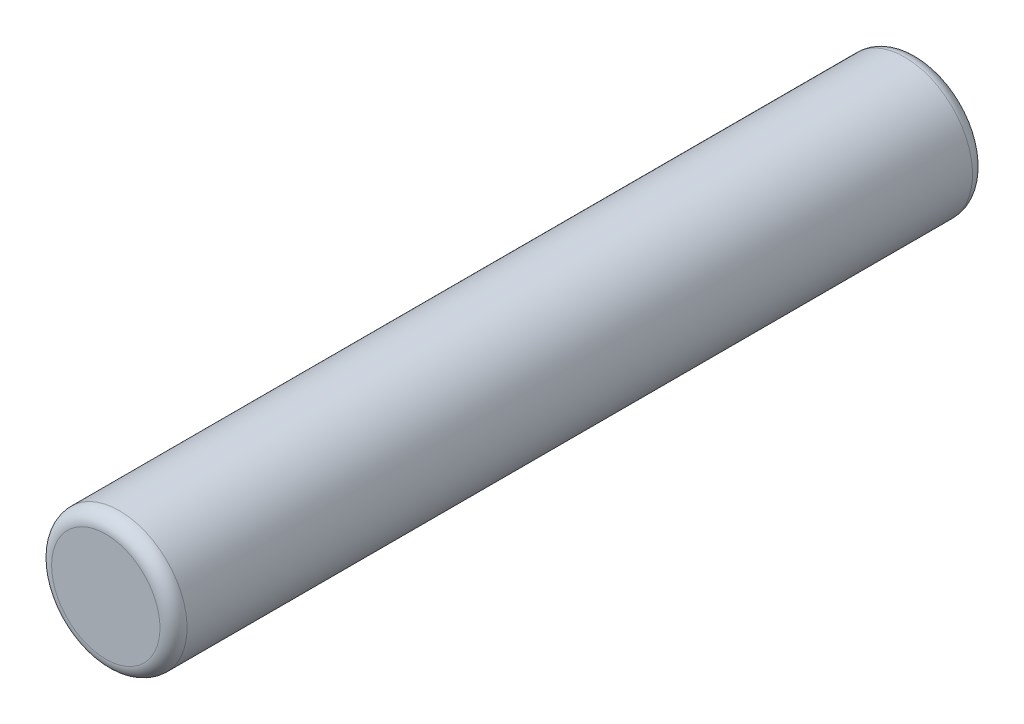
ISO-10303-21;
HEADER;
FILE_DESCRIPTION(('STEP AP214'),'2;1');
FILE_NAME('part.step','',(''),(''),'','','');
FILE_SCHEMA(('AUTOMOTIVE_DESIGN { 1 0 10303 214 1 1 1 1 }'));
ENDSEC;
DATA;
#1=APPLICATION_CONTEXT('core data for automotive mechanical design processes');
#2=APPLICATION_PROTOCOL_DEFINITION('international standard','automotive_design',2000,#1);
#3=PRODUCT_CONTEXT('',#1,'mechanical');
#4=PRODUCT('Part','Part','',(#3));
#5=PRODUCT_RELATED_PRODUCT_CATEGORY('part','',(#4));
#6=PRODUCT_DEFINITION_FORMATION('','',#4);
#7=PRODUCT_DEFINITION_CONTEXT('part definition',#1,'design');
#8=PRODUCT_DEFINITION('design','',#6,#7);
#9=PRODUCT_DEFINITION_SHAPE('','',#8);
#10=(LENGTH_UNIT() NAMED_UNIT(*) SI_UNIT(.MILLI.,.METRE.));
#11=(NAMED_UNIT(*) PLANE_ANGLE_UNIT() SI_UNIT($,.RADIAN.));
#12=(NAMED_UNIT(*) SI_UNIT($,.STERADIAN.) SOLID_ANGLE_UNIT());
#13=UNCERTAINTY_MEASURE_WITH_UNIT(LENGTH_MEASURE(1.E-05),#10,'distance_accuracy_value','');
#14=(GEOMETRIC_REPRESENTATION_CONTEXT(3) GLOBAL_UNCERTAINTY_ASSIGNED_CONTEXT((#13)) GLOBAL_UNIT_ASSIGNED_CONTEXT((#10,
#11,#12)) REPRESENTATION_CONTEXT('',''));
#15=CARTESIAN_POINT('',(0.,0.,0.));
#16=DIRECTION('',(0.,0.,1.));
#17=DIRECTION('',(1.,0.,0.));
#18=AXIS2_PLACEMENT_3D('',#15,#16,#17);
#19=CARTESIAN_POINT('',(1.17557050458523,-1.6180339887498,3.));
#20=DIRECTION('',(0.,0.,1.));
#21=DIRECTION('',(1.,0.,0.));
#22=AXIS2_PLACEMENT_3D('',#19,#20,#21);
#23=PLANE('',#22);
#24=CARTESIAN_POINT('',(1.17557050458523,-1.6180339887498,3.));
#25=DIRECTION('',(0.,0.,-1.));
#26=DIRECTION('',(-1.,0.,0.));
#27=AXIS2_PLACEMENT_3D('',#24,#25,#26);
#28=CIRCLE('',#27,0.4);
#29=CARTESIAN_POINT('',(0.77557050458523,-1.6180339887498,3.));
#30=VERTEX_POINT('',#29);
#31=EDGE_CURVE('E62',#30,#30,#28,.T.);
#32=ORIENTED_EDGE('',*,*,#31,.F.);
#33=EDGE_LOOP('',(#32));
#34=FACE_BOUND('',#33,.T.);
#35=ADVANCED_FACE('F15',(#34),#23,.T.);
#36=CARTESIAN_POINT('',(1.17557050458523,-1.6180339887498,-3.));
#37=DIRECTION('',(0.,0.,1.));
#38=DIRECTION('',(1.,0.,0.));
#39=AXIS2_PLACEMENT_3D('',#36,#37,#38);
#40=PLANE('',#39);
#41=CARTESIAN_POINT('',(1.17557050458523,-1.6180339887498,-3.));
#42=DIRECTION('',(0.,0.,1.));
#43=DIRECTION('',(-1.,0.,0.));
#44=AXIS2_PLACEMENT_3D('',#41,#42,#43);
#45=CIRCLE('',#44,0.4);
#46=CARTESIAN_POINT('',(0.77557050458523,-1.6180339887498,-3.));
#47=VERTEX_POINT('',#46);
#48=EDGE_CURVE('E30',#47,#47,#45,.T.);
#49=ORIENTED_EDGE('',*,*,#48,.F.);
#50=EDGE_LOOP('',(#49));
#51=FACE_BOUND('',#50,.T.);
#52=ADVANCED_FACE('F75',(#51),#40,.F.);
#53=CARTESIAN_POINT('',(1.17557050458523,-1.6180339887498,2.9));
#54=DIRECTION('',(0.,0.,-1.));
#55=DIRECTION('',(1.,0.,0.));
#56=AXIS2_PLACEMENT_3D('',#53,#54,#55);
#57=TOROIDAL_SURFACE('',#56,0.4,0.1);
#58=ORIENTED_EDGE('',*,*,#31,.T.);
#59=EDGE_LOOP('',(#58));
#60=FACE_BOUND('',#59,.T.);
#61=CARTESIAN_POINT('',(1.17557050458523,-1.6180339887498,2.9));
#62=DIRECTION('',(0.,0.,-1.));
#63=DIRECTION('',(-1.,0.,0.));
#64=AXIS2_PLACEMENT_3D('',#61,#62,#63);
#65=CIRCLE('',#64,0.5);
#66=CARTESIAN_POINT('',(0.67557050458523,-1.6180339887498,2.9));
#67=VERTEX_POINT('',#66);
#68=EDGE_CURVE('E25',#67,#67,#65,.T.);
#69=ORIENTED_EDGE('',*,*,#68,.F.);
#70=EDGE_LOOP('',(#69));
#71=FACE_BOUND('',#70,.T.);
#72=ADVANCED_FACE('F43',(#60,#71),#57,.T.);
#73=CARTESIAN_POINT('',(1.17557050458523,-1.6180339887498,-2.9));
#74=DIRECTION('',(0.,0.,-1.));
#75=DIRECTION('',(1.,0.,0.));
#76=AXIS2_PLACEMENT_3D('',#73,#74,#75);
#77=TOROIDAL_SURFACE('',#76,0.4,0.1);
#78=CARTESIAN_POINT('',(1.17557050458523,-1.6180339887498,-2.9));
#79=DIRECTION('',(0.,0.,-1.));
#80=DIRECTION('',(-1.,0.,0.));
#81=AXIS2_PLACEMENT_3D('',#78,#79,#80);
#82=CIRCLE('',#81,0.5);
#83=CARTESIAN_POINT('',(0.67557050458523,-1.6180339887498,-2.9));
#84=VERTEX_POINT('',#83);
#85=EDGE_CURVE('E10',#84,#84,#82,.F.);
#86=ORIENTED_EDGE('',*,*,#85,.F.);
#87=EDGE_LOOP('',(#86));
#88=FACE_BOUND('',#87,.T.);
#89=ORIENTED_EDGE('',*,*,#48,.T.);
#90=EDGE_LOOP('',(#89));
#91=FACE_BOUND('',#90,.T.);
#92=ADVANCED_FACE('F38',(#88,#91),#77,.T.);
#93=CARTESIAN_POINT('',(1.17557050458523,-1.6180339887498,-3.));
#94=DIRECTION('',(0.,0.,-1.));
#95=DIRECTION('',(-1.,0.,0.));
#96=AXIS2_PLACEMENT_3D('',#93,#94,#95);
#97=CYLINDRICAL_SURFACE('',#96,0.5);
#98=ORIENTED_EDGE('',*,*,#85,.T.);
#99=EDGE_LOOP('',(#98));
#100=FACE_BOUND('',#99,.T.);
#101=ORIENTED_EDGE('',*,*,#68,.T.);
#102=EDGE_LOOP('',(#101));
#103=FACE_BOUND('',#102,.T.);
#104=ADVANCED_FACE('F42',(#100,#103),#97,.T.);
#105=CLOSED_SHELL('',(#35,#52,#72,#92,#104));
#106=MANIFOLD_SOLID_BREP('B1',#105);
#107=ADVANCED_BREP_SHAPE_REPRESENTATION('',(#18,#106),#14);
#108=SHAPE_DEFINITION_REPRESENTATION(#9,#107);
ENDSEC;
END-ISO-10303-21;
